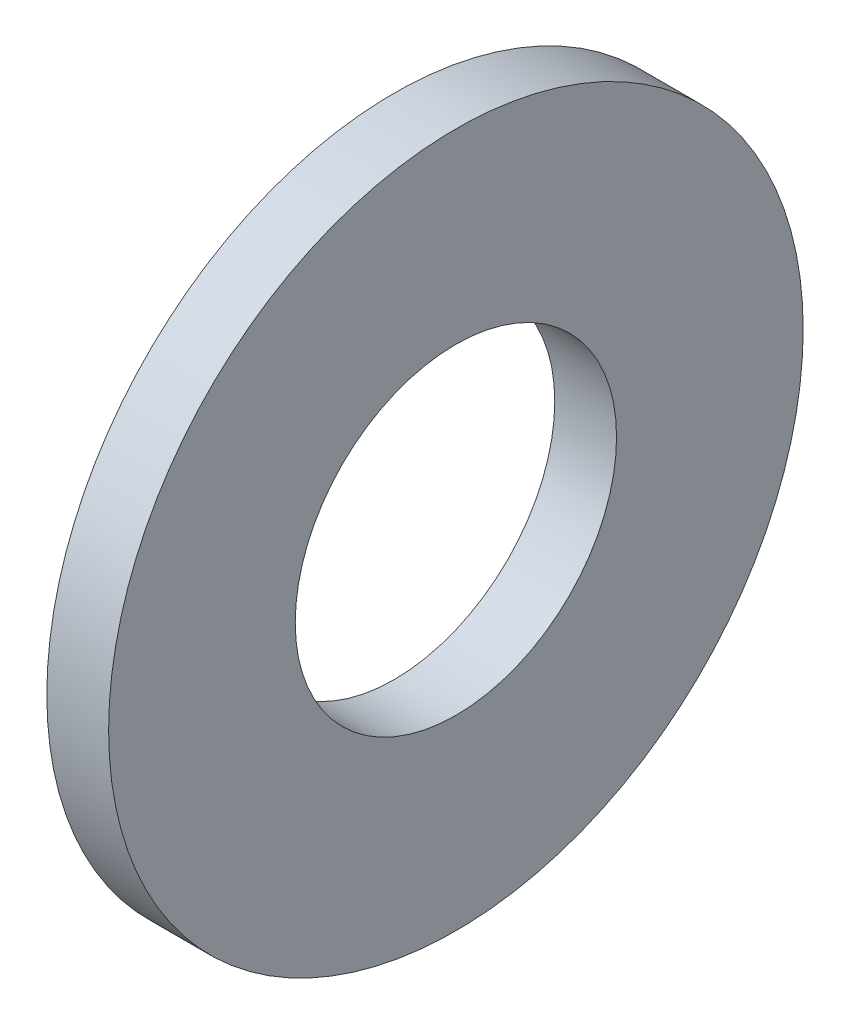
ISO-10303-21;
HEADER;
FILE_DESCRIPTION(('STEP AP214'),'2;1');
FILE_NAME('part.step','',(''),(''),'','','');
FILE_SCHEMA(('AUTOMOTIVE_DESIGN { 1 0 10303 214 1 1 1 1 }'));
ENDSEC;
DATA;
#1=APPLICATION_CONTEXT('core data for automotive mechanical design processes');
#2=APPLICATION_PROTOCOL_DEFINITION('international standard','automotive_design',2000,#1);
#3=PRODUCT_CONTEXT('',#1,'mechanical');
#4=PRODUCT('Part','Part','',(#3));
#5=PRODUCT_RELATED_PRODUCT_CATEGORY('part','',(#4));
#6=PRODUCT_DEFINITION_FORMATION('','',#4);
#7=PRODUCT_DEFINITION_CONTEXT('part definition',#1,'design');
#8=PRODUCT_DEFINITION('design','',#6,#7);
#9=PRODUCT_DEFINITION_SHAPE('','',#8);
#10=(LENGTH_UNIT() NAMED_UNIT(*) SI_UNIT(.MILLI.,.METRE.));
#11=(NAMED_UNIT(*) PLANE_ANGLE_UNIT() SI_UNIT($,.RADIAN.));
#12=(NAMED_UNIT(*) SI_UNIT($,.STERADIAN.) SOLID_ANGLE_UNIT());
#13=UNCERTAINTY_MEASURE_WITH_UNIT(LENGTH_MEASURE(1.E-05),#10,'distance_accuracy_value','');
#14=(GEOMETRIC_REPRESENTATION_CONTEXT(3) GLOBAL_UNCERTAINTY_ASSIGNED_CONTEXT((#13)) GLOBAL_UNIT_ASSIGNED_CONTEXT((#10,
#11,#12)) REPRESENTATION_CONTEXT('',''));
#15=CARTESIAN_POINT('',(0.,0.,0.));
#16=DIRECTION('',(0.,0.,1.));
#17=DIRECTION('',(1.,0.,0.));
#18=AXIS2_PLACEMENT_3D('',#15,#16,#17);
#19=CARTESIAN_POINT('',(1.27,0.,0.));
#20=DIRECTION('',(1.,0.,0.));
#21=DIRECTION('',(0.,0.,-1.));
#22=AXIS2_PLACEMENT_3D('',#19,#20,#21);
#23=PLANE('',#22);
#24=CARTESIAN_POINT('',(1.27,0.,0.));
#25=DIRECTION('',(1.,0.,0.));
#26=DIRECTION('',(0.,0.,-1.));
#27=AXIS2_PLACEMENT_3D('',#24,#25,#26);
#28=CIRCLE('',#27,7.1374);
#29=CARTESIAN_POINT('',(1.27,0.,-7.1374));
#30=VERTEX_POINT('',#29);
#31=EDGE_CURVE('E10',#30,#30,#28,.T.);
#32=ORIENTED_EDGE('',*,*,#31,.T.);
#33=EDGE_LOOP('',(#32));
#34=FACE_BOUND('',#33,.T.);
#35=CARTESIAN_POINT('',(1.27,0.,0.));
#36=DIRECTION('',(1.,0.,0.));
#37=DIRECTION('',(0.,0.,-1.));
#38=AXIS2_PLACEMENT_3D('',#35,#36,#37);
#39=CIRCLE('',#38,3.302);
#40=CARTESIAN_POINT('',(1.27,0.,-3.302));
#41=VERTEX_POINT('',#40);
#42=EDGE_CURVE('E41',#41,#41,#39,.T.);
#43=ORIENTED_EDGE('',*,*,#42,.F.);
#44=EDGE_LOOP('',(#43));
#45=FACE_BOUND('',#44,.T.);
#46=ADVANCED_FACE('F30',(#34,#45),#23,.T.);
#47=CARTESIAN_POINT('',(0.,0.,0.));
#48=DIRECTION('',(1.,0.,0.));
#49=DIRECTION('',(0.,0.,-1.));
#50=AXIS2_PLACEMENT_3D('',#47,#48,#49);
#51=PLANE('',#50);
#52=CARTESIAN_POINT('',(0.,0.,0.));
#53=DIRECTION('',(1.,0.,0.));
#54=DIRECTION('',(0.,0.,-1.));
#55=AXIS2_PLACEMENT_3D('',#52,#53,#54);
#56=CIRCLE('',#55,7.1374);
#57=CARTESIAN_POINT('',(0.,0.,-7.1374));
#58=VERTEX_POINT('',#57);
#59=EDGE_CURVE('E34',#58,#58,#56,.T.);
#60=ORIENTED_EDGE('',*,*,#59,.F.);
#61=EDGE_LOOP('',(#60));
#62=FACE_BOUND('',#61,.T.);
#63=CARTESIAN_POINT('',(0.,0.,0.));
#64=DIRECTION('',(1.,0.,0.));
#65=DIRECTION('',(0.,0.,-1.));
#66=AXIS2_PLACEMENT_3D('',#63,#64,#65);
#67=CIRCLE('',#66,3.302);
#68=CARTESIAN_POINT('',(0.,0.,-3.302));
#69=VERTEX_POINT('',#68);
#70=EDGE_CURVE('E43',#69,#69,#67,.T.);
#71=ORIENTED_EDGE('',*,*,#70,.T.);
#72=EDGE_LOOP('',(#71));
#73=FACE_BOUND('',#72,.T.);
#74=ADVANCED_FACE('F53',(#62,#73),#51,.F.);
#75=CARTESIAN_POINT('',(1.27,0.,0.));
#76=DIRECTION('',(-1.,0.,0.));
#77=DIRECTION('',(0.,0.,1.));
#78=AXIS2_PLACEMENT_3D('',#75,#76,#77);
#79=CYLINDRICAL_SURFACE('',#78,7.1374);
#80=ORIENTED_EDGE('',*,*,#31,.F.);
#81=EDGE_LOOP('',(#80));
#82=FACE_BOUND('',#81,.T.);
#83=ORIENTED_EDGE('',*,*,#59,.T.);
#84=EDGE_LOOP('',(#83));
#85=FACE_BOUND('',#84,.T.);
#86=ADVANCED_FACE('F32',(#82,#85),#79,.T.);
#87=CARTESIAN_POINT('',(1.27,0.,0.));
#88=DIRECTION('',(-1.,0.,0.));
#89=DIRECTION('',(0.,0.,1.));
#90=AXIS2_PLACEMENT_3D('',#87,#88,#89);
#91=CYLINDRICAL_SURFACE('',#90,3.302);
#92=ORIENTED_EDGE('',*,*,#42,.T.);
#93=EDGE_LOOP('',(#92));
#94=FACE_BOUND('',#93,.T.);
#95=ORIENTED_EDGE('',*,*,#70,.F.);
#96=EDGE_LOOP('',(#95));
#97=FACE_BOUND('',#96,.T.);
#98=ADVANCED_FACE('F49',(#94,#97),#91,.F.);
#99=CLOSED_SHELL('',(#46,#74,#86,#98));
#100=MANIFOLD_SOLID_BREP('B2',#99);
#101=ADVANCED_BREP_SHAPE_REPRESENTATION('',(#18,#100),#14);
#102=SHAPE_DEFINITION_REPRESENTATION(#9,#101);
ENDSEC;
END-ISO-10303-21;
